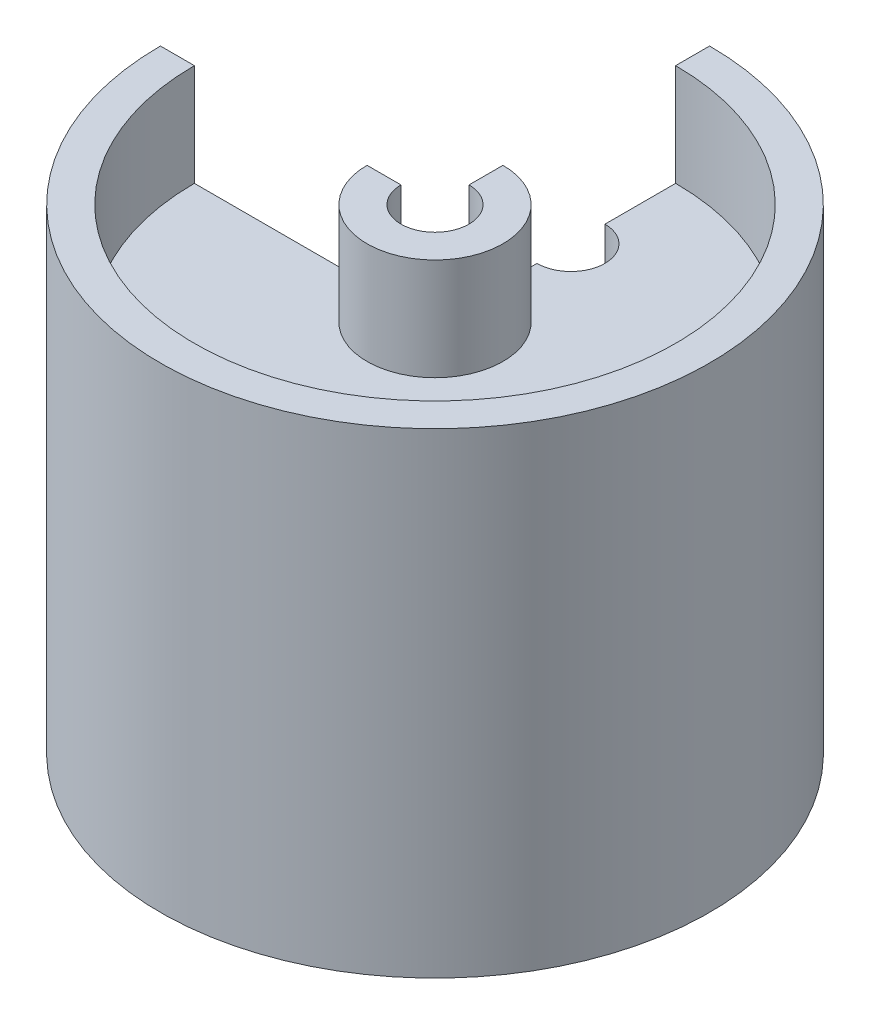
ISO-10303-21;
HEADER;
FILE_DESCRIPTION(('STEP AP214'),'2;1');
FILE_NAME('part.step','',(''),(''),'','','');
FILE_SCHEMA(('AUTOMOTIVE_DESIGN { 1 0 10303 214 1 1 1 1 }'));
ENDSEC;
DATA;
#1=APPLICATION_CONTEXT('core data for automotive mechanical design processes');
#2=APPLICATION_PROTOCOL_DEFINITION('international standard','automotive_design',2000,#1);
#3=PRODUCT_CONTEXT('',#1,'mechanical');
#4=PRODUCT('Part','Part','',(#3));
#5=PRODUCT_RELATED_PRODUCT_CATEGORY('part','',(#4));
#6=PRODUCT_DEFINITION_FORMATION('','',#4);
#7=PRODUCT_DEFINITION_CONTEXT('part definition',#1,'design');
#8=PRODUCT_DEFINITION('design','',#6,#7);
#9=PRODUCT_DEFINITION_SHAPE('','',#8);
#10=(LENGTH_UNIT() NAMED_UNIT(*) SI_UNIT(.MILLI.,.METRE.));
#11=(NAMED_UNIT(*) PLANE_ANGLE_UNIT() SI_UNIT($,.RADIAN.));
#12=(NAMED_UNIT(*) SI_UNIT($,.STERADIAN.) SOLID_ANGLE_UNIT());
#13=UNCERTAINTY_MEASURE_WITH_UNIT(LENGTH_MEASURE(1.E-05),#10,'distance_accuracy_value','');
#14=(GEOMETRIC_REPRESENTATION_CONTEXT(3) GLOBAL_UNCERTAINTY_ASSIGNED_CONTEXT((#13)) GLOBAL_UNIT_ASSIGNED_CONTEXT((#10,
#11,#12)) REPRESENTATION_CONTEXT('',''));
#15=CARTESIAN_POINT('',(0.,0.,0.));
#16=DIRECTION('',(0.,0.,1.));
#17=DIRECTION('',(1.,0.,0.));
#18=AXIS2_PLACEMENT_3D('',#15,#16,#17);
#19=CARTESIAN_POINT('',(0.,0.,0.));
#20=DIRECTION('',(1.,0.,0.));
#21=DIRECTION('',(0.,0.,-1.));
#22=AXIS2_PLACEMENT_3D('',#19,#20,#21);
#23=PLANE('',#22);
#24=DIRECTION('',(0.,-1.,0.));
#25=VECTOR('',#24,1.);
#26=CARTESIAN_POINT('',(0.,45.0234349741081,-9.525));
#27=LINE('',#26,#25);
#28=CARTESIAN_POINT('',(0.,32.3234349741081,-9.525));
#29=VERTEX_POINT('',#28);
#30=CARTESIAN_POINT('',(0.,35.4984349741081,-9.525));
#31=VERTEX_POINT('',#30);
#32=EDGE_CURVE('E11',#29,#31,#27,.F.);
#33=ORIENTED_EDGE('',*,*,#32,.F.);
#34=DIRECTION('',(0.,0.,-1.));
#35=VECTOR('',#34,1.);
#36=CARTESIAN_POINT('',(0.,32.3234349741081,-22.479));
#37=LINE('',#36,#35);
#38=CARTESIAN_POINT('',(0.,32.3234349741081,-6.35));
#39=VERTEX_POINT('',#38);
#40=EDGE_CURVE('E154',#39,#29,#37,.T.);
#41=ORIENTED_EDGE('',*,*,#40,.F.);
#42=DIRECTION('',(0.,1.,0.));
#43=VECTOR('',#42,1.);
#44=CARTESIAN_POINT('',(0.,32.3234349741081,-6.35));
#45=LINE('',#44,#43);
#46=CARTESIAN_POINT('',(0.,0.57343497410807,-6.35));
#47=VERTEX_POINT('',#46);
#48=EDGE_CURVE('E164',#47,#39,#45,.T.);
#49=ORIENTED_EDGE('',*,*,#48,.F.);
#50=DIRECTION('',(0.,0.,-1.));
#51=VECTOR('',#50,1.);
#52=CARTESIAN_POINT('',(0.,0.57343497410807,-3.17500000000001));
#53=LINE('',#52,#51);
#54=CARTESIAN_POINT('',(0.,0.57343497410807,-3.17500000000001));
#55=VERTEX_POINT('',#54);
#56=EDGE_CURVE('E169',#55,#47,#53,.T.);
#57=ORIENTED_EDGE('',*,*,#56,.F.);
#58=DIRECTION('',(0.,-1.,0.));
#59=VECTOR('',#58,1.);
#60=CARTESIAN_POINT('',(0.,45.0234349741081,-3.175));
#61=LINE('',#60,#59);
#62=CARTESIAN_POINT('',(0.,45.0234349741081,-3.175));
#63=VERTEX_POINT('',#62);
#64=EDGE_CURVE('E285',#63,#55,#61,.T.);
#65=ORIENTED_EDGE('',*,*,#64,.F.);
#66=DIRECTION('',(0.,0.,1.));
#67=VECTOR('',#66,1.);
#68=CARTESIAN_POINT('',(0.,45.0234349741081,-6.35));
#69=LINE('',#68,#67);
#70=CARTESIAN_POINT('',(0.,45.0234349741081,-6.35));
#71=VERTEX_POINT('',#70);
#72=EDGE_CURVE('E156',#71,#63,#69,.T.);
#73=ORIENTED_EDGE('',*,*,#72,.F.);
#74=DIRECTION('',(0.,1.,0.));
#75=VECTOR('',#74,1.);
#76=CARTESIAN_POINT('',(0.,35.4984349741081,-6.35));
#77=LINE('',#76,#75);
#78=CARTESIAN_POINT('',(0.,35.4984349741081,-6.35));
#79=VERTEX_POINT('',#78);
#80=EDGE_CURVE('E195',#79,#71,#77,.T.);
#81=ORIENTED_EDGE('',*,*,#80,.F.);
#82=DIRECTION('',(0.,0.,1.));
#83=VECTOR('',#82,1.);
#84=CARTESIAN_POINT('',(0.,35.4984349741081,-22.479));
#85=LINE('',#84,#83);
#86=EDGE_CURVE('E191',#31,#79,#85,.T.);
#87=ORIENTED_EDGE('',*,*,#86,.F.);
#88=EDGE_LOOP('',(#33,#41,#49,#57,#65,#73,#81,#87));
#89=FACE_BOUND('',#88,.T.);
#90=ADVANCED_FACE('F39',(#89),#23,.F.);
#91=DIRECTION('',(0.,-1.,0.));
#92=VECTOR('',#91,1.);
#93=CARTESIAN_POINT('',(0.,45.0234349741081,-15.875));
#94=LINE('',#93,#92);
#95=CARTESIAN_POINT('',(0.,35.4984349741081,-15.875));
#96=VERTEX_POINT('',#95);
#97=CARTESIAN_POINT('',(0.,32.3234349741081,-15.875));
#98=VERTEX_POINT('',#97);
#99=EDGE_CURVE('E48',#96,#98,#94,.T.);
#100=ORIENTED_EDGE('',*,*,#99,.F.);
#101=CARTESIAN_POINT('',(0.,35.4984349741081,-22.479));
#102=VERTEX_POINT('',#101);
#103=EDGE_CURVE('E192',#102,#96,#85,.T.);
#104=ORIENTED_EDGE('',*,*,#103,.F.);
#105=DIRECTION('',(0.,-1.,0.));
#106=VECTOR('',#105,1.);
#107=CARTESIAN_POINT('',(0.,35.4984349741081,-22.479));
#108=LINE('',#107,#106);
#109=CARTESIAN_POINT('',(0.,45.0234349741081,-22.479));
#110=VERTEX_POINT('',#109);
#111=EDGE_CURVE('E187',#110,#102,#108,.T.);
#112=ORIENTED_EDGE('',*,*,#111,.F.);
#113=DIRECTION('',(0.,0.,1.));
#114=VECTOR('',#113,1.);
#115=CARTESIAN_POINT('',(0.,45.0234349741081,-22.479));
#116=LINE('',#115,#114);
#117=CARTESIAN_POINT('',(0.,45.0234349741081,-25.654));
#118=VERTEX_POINT('',#117);
#119=EDGE_CURVE('E183',#118,#110,#116,.T.);
#120=ORIENTED_EDGE('',*,*,#119,.F.);
#121=DIRECTION('',(0.,1.,0.));
#122=VECTOR('',#121,1.);
#123=CARTESIAN_POINT('',(0.,45.0234349741081,-25.654));
#124=LINE('',#123,#122);
#125=CARTESIAN_POINT('',(0.,0.573434974108077,-25.654));
#126=VERTEX_POINT('',#125);
#127=EDGE_CURVE('E179',#126,#118,#124,.T.);
#128=ORIENTED_EDGE('',*,*,#127,.F.);
#129=DIRECTION('',(0.,0.,-1.));
#130=VECTOR('',#129,1.);
#131=CARTESIAN_POINT('',(0.,0.573434974108077,-25.654));
#132=LINE('',#131,#130);
#133=CARTESIAN_POINT('',(0.,0.573434974108077,-22.479));
#134=VERTEX_POINT('',#133);
#135=EDGE_CURVE('E175',#134,#126,#132,.T.);
#136=ORIENTED_EDGE('',*,*,#135,.F.);
#137=DIRECTION('',(0.,-1.,0.));
#138=VECTOR('',#137,1.);
#139=CARTESIAN_POINT('',(0.,0.573434974108077,-22.479));
#140=LINE('',#139,#138);
#141=CARTESIAN_POINT('',(0.,32.3234349741081,-22.479));
#142=VERTEX_POINT('',#141);
#143=EDGE_CURVE('E162',#142,#134,#140,.T.);
#144=ORIENTED_EDGE('',*,*,#143,.F.);
#145=EDGE_CURVE('E151',#98,#142,#37,.T.);
#146=ORIENTED_EDGE('',*,*,#145,.F.);
#147=EDGE_LOOP('',(#100,#104,#112,#120,#128,#136,#144,#146));
#148=FACE_BOUND('',#147,.T.);
#149=ADVANCED_FACE('F159',(#148),#23,.F.);
#150=CARTESIAN_POINT('',(-6.35,45.0234349741081,0.));
#151=DIRECTION('',(0.,-1.,0.));
#152=DIRECTION('',(0.,0.,-1.));
#153=AXIS2_PLACEMENT_3D('',#150,#151,#152);
#154=PLANE('',#153);
#155=CARTESIAN_POINT('',(0.,45.0234349741081,0.));
#156=DIRECTION('',(0.,1.,0.));
#157=DIRECTION('',(0.,0.,1.));
#158=AXIS2_PLACEMENT_3D('',#155,#156,#157);
#159=CIRCLE('',#158,3.175);
#160=CARTESIAN_POINT('',(-3.175,45.0234349741081,0.));
#161=VERTEX_POINT('',#160);
#162=EDGE_CURVE('E147',#161,#63,#159,.T.);
#163=ORIENTED_EDGE('',*,*,#162,.F.);
#164=DIRECTION('',(1.,0.,0.));
#165=VECTOR('',#164,1.);
#166=CARTESIAN_POINT('',(-6.35,45.0234349741081,0.));
#167=LINE('',#166,#165);
#168=CARTESIAN_POINT('',(-6.35,45.0234349741081,0.));
#169=VERTEX_POINT('',#168);
#170=EDGE_CURVE('E198',#169,#161,#167,.T.);
#171=ORIENTED_EDGE('',*,*,#170,.F.);
#172=CARTESIAN_POINT('',(0.,45.0234349741081,0.));
#173=DIRECTION('',(0.,1.,0.));
#174=DIRECTION('',(0.,0.,1.));
#175=AXIS2_PLACEMENT_3D('',#172,#173,#174);
#176=CIRCLE('',#175,6.35);
#177=EDGE_CURVE('E62',#169,#71,#176,.T.);
#178=ORIENTED_EDGE('',*,*,#177,.T.);
#179=ORIENTED_EDGE('',*,*,#72,.T.);
#180=EDGE_LOOP('',(#163,#171,#178,#179));
#181=FACE_BOUND('',#180,.T.);
#182=ADVANCED_FACE('F289',(#181),#154,.F.);
#183=CARTESIAN_POINT('',(0.,45.0234349741081,0.));
#184=DIRECTION('',(0.,1.,0.));
#185=DIRECTION('',(0.,0.,1.));
#186=AXIS2_PLACEMENT_3D('',#183,#184,#185);
#187=CYLINDRICAL_SURFACE('',#186,3.175);
#188=CARTESIAN_POINT('',(0.,0.57343497410807,0.));
#189=DIRECTION('',(0.,1.,0.));
#190=DIRECTION('',(0.,0.,1.));
#191=AXIS2_PLACEMENT_3D('',#188,#189,#190);
#192=CIRCLE('',#191,3.17500000000001);
#193=CARTESIAN_POINT('',(-3.17500000000001,0.57343497410807,0.));
#194=VERTEX_POINT('',#193);
#195=EDGE_CURVE('E276',#194,#55,#192,.T.);
#196=ORIENTED_EDGE('',*,*,#195,.F.);
#197=DIRECTION('',(0.,-1.,0.));
#198=VECTOR('',#197,1.);
#199=CARTESIAN_POINT('',(-3.175,45.0234349741081,0.));
#200=LINE('',#199,#198);
#201=EDGE_CURVE('E202',#161,#194,#200,.T.);
#202=ORIENTED_EDGE('',*,*,#201,.F.);
#203=ORIENTED_EDGE('',*,*,#162,.T.);
#204=ORIENTED_EDGE('',*,*,#64,.T.);
#205=EDGE_LOOP('',(#196,#202,#203,#204));
#206=FACE_BOUND('',#205,.T.);
#207=ADVANCED_FACE('F41',(#206),#187,.F.);
#208=CARTESIAN_POINT('',(-3.17500000000001,0.57343497410807,0.));
#209=DIRECTION('',(0.,1.,0.));
#210=DIRECTION('',(0.,0.,1.));
#211=AXIS2_PLACEMENT_3D('',#208,#209,#210);
#212=PLANE('',#211);
#213=CARTESIAN_POINT('',(0.,0.57343497410807,0.));
#214=DIRECTION('',(0.,1.,0.));
#215=DIRECTION('',(0.,0.,1.));
#216=AXIS2_PLACEMENT_3D('',#213,#214,#215);
#217=CIRCLE('',#216,6.35);
#218=CARTESIAN_POINT('',(-6.35,0.57343497410807,0.));
#219=VERTEX_POINT('',#218);
#220=EDGE_CURVE('E273',#219,#47,#217,.T.);
#221=ORIENTED_EDGE('',*,*,#220,.F.);
#222=DIRECTION('',(-1.,0.,0.));
#223=VECTOR('',#222,1.);
#224=CARTESIAN_POINT('',(-3.17500000000001,0.57343497410807,0.));
#225=LINE('',#224,#223);
#226=EDGE_CURVE('E206',#194,#219,#225,.T.);
#227=ORIENTED_EDGE('',*,*,#226,.F.);
#228=ORIENTED_EDGE('',*,*,#195,.T.);
#229=ORIENTED_EDGE('',*,*,#56,.T.);
#230=EDGE_LOOP('',(#221,#227,#228,#229));
#231=FACE_BOUND('',#230,.T.);
#232=ADVANCED_FACE('F302',(#231),#212,.F.);
#233=CARTESIAN_POINT('',(0.,45.0234349741081,0.));
#234=DIRECTION('',(0.,1.,0.));
#235=DIRECTION('',(0.,0.,1.));
#236=AXIS2_PLACEMENT_3D('',#233,#234,#235);
#237=CYLINDRICAL_SURFACE('',#236,6.35);
#238=CARTESIAN_POINT('',(0.,32.3234349741081,0.));
#239=DIRECTION('',(0.,1.,0.));
#240=DIRECTION('',(0.,0.,1.));
#241=AXIS2_PLACEMENT_3D('',#238,#239,#240);
#242=CIRCLE('',#241,6.35);
#243=CARTESIAN_POINT('',(-6.35,32.3234349741081,0.));
#244=VERTEX_POINT('',#243);
#245=EDGE_CURVE('E270',#244,#39,#242,.T.);
#246=ORIENTED_EDGE('',*,*,#245,.F.);
#247=DIRECTION('',(0.,1.,0.));
#248=VECTOR('',#247,1.);
#249=CARTESIAN_POINT('',(-6.35,32.3234349741081,0.));
#250=LINE('',#249,#248);
#251=EDGE_CURVE('E210',#219,#244,#250,.T.);
#252=ORIENTED_EDGE('',*,*,#251,.F.);
#253=ORIENTED_EDGE('',*,*,#220,.T.);
#254=ORIENTED_EDGE('',*,*,#48,.T.);
#255=EDGE_LOOP('',(#246,#252,#253,#254));
#256=FACE_BOUND('',#255,.T.);
#257=ADVANCED_FACE('F305',(#256),#237,.T.);
#258=CARTESIAN_POINT('',(-22.479,32.3234349741081,-2.35455027047564E-13));
#259=DIRECTION('',(0.,1.,0.));
#260=DIRECTION('',(0.,0.,1.));
#261=AXIS2_PLACEMENT_3D('',#258,#259,#260);
#262=PLANE('',#261);
#263=CARTESIAN_POINT('',(0.,32.3234349741081,-12.7));
#264=DIRECTION('',(0.,1.,0.));
#265=DIRECTION('',(0.,0.,1.));
#266=AXIS2_PLACEMENT_3D('',#263,#264,#265);
#267=CIRCLE('',#266,3.175);
#268=EDGE_CURVE('E140',#98,#29,#267,.F.);
#269=ORIENTED_EDGE('',*,*,#268,.F.);
#270=ORIENTED_EDGE('',*,*,#145,.T.);
#271=CARTESIAN_POINT('',(0.,32.3234349741081,0.));
#272=DIRECTION('',(0.,1.,0.));
#273=DIRECTION('',(0.,0.,1.));
#274=AXIS2_PLACEMENT_3D('',#271,#272,#273);
#275=CIRCLE('',#274,22.479);
#276=CARTESIAN_POINT('',(-22.479,32.3234349741081,-2.35455027047564E-13));
#277=VERTEX_POINT('',#276);
#278=EDGE_CURVE('E267',#277,#142,#275,.T.);
#279=ORIENTED_EDGE('',*,*,#278,.F.);
#280=DIRECTION('',(-1.,0.,0.));
#281=VECTOR('',#280,1.);
#282=CARTESIAN_POINT('',(-22.479,32.3234349741081,-2.35455027047564E-13));
#283=LINE('',#282,#281);
#284=EDGE_CURVE('E214',#244,#277,#283,.T.);
#285=ORIENTED_EDGE('',*,*,#284,.F.);
#286=ORIENTED_EDGE('',*,*,#245,.T.);
#287=ORIENTED_EDGE('',*,*,#40,.T.);
#288=EDGE_LOOP('',(#269,#270,#279,#285,#286,#287));
#289=FACE_BOUND('',#288,.T.);
#290=ADVANCED_FACE('F150',(#289),#262,.F.);
#291=CARTESIAN_POINT('',(0.,45.0234349741081,0.));
#292=DIRECTION('',(0.,1.,0.));
#293=DIRECTION('',(0.,0.,1.));
#294=AXIS2_PLACEMENT_3D('',#291,#292,#293);
#295=CYLINDRICAL_SURFACE('',#294,22.479);
#296=CARTESIAN_POINT('',(0.,0.573434974108077,0.));
#297=DIRECTION('',(0.,1.,0.));
#298=DIRECTION('',(0.,0.,1.));
#299=AXIS2_PLACEMENT_3D('',#296,#297,#298);
#300=CIRCLE('',#299,22.479);
#301=CARTESIAN_POINT('',(-22.479,0.573434974108077,-2.35455027047564E-13));
#302=VERTEX_POINT('',#301);
#303=EDGE_CURVE('E264',#302,#134,#300,.T.);
#304=ORIENTED_EDGE('',*,*,#303,.F.);
#305=DIRECTION('',(0.,-1.,0.));
#306=VECTOR('',#305,1.);
#307=CARTESIAN_POINT('',(-22.479,0.573434974108077,-2.35455027047564E-13));
#308=LINE('',#307,#306);
#309=EDGE_CURVE('E218',#277,#302,#308,.T.);
#310=ORIENTED_EDGE('',*,*,#309,.F.);
#311=ORIENTED_EDGE('',*,*,#278,.T.);
#312=ORIENTED_EDGE('',*,*,#143,.T.);
#313=EDGE_LOOP('',(#304,#310,#311,#312));
#314=FACE_BOUND('',#313,.T.);
#315=ADVANCED_FACE('F312',(#314),#295,.F.);
#316=CARTESIAN_POINT('',(-25.654,0.573434974108077,-2.68711386800045E-13));
#317=DIRECTION('',(0.,1.,0.));
#318=DIRECTION('',(0.,0.,1.));
#319=AXIS2_PLACEMENT_3D('',#316,#317,#318);
#320=PLANE('',#319);
#321=CARTESIAN_POINT('',(0.,0.573434974108077,0.));
#322=DIRECTION('',(0.,1.,0.));
#323=DIRECTION('',(0.,0.,1.));
#324=AXIS2_PLACEMENT_3D('',#321,#322,#323);
#325=CIRCLE('',#324,25.654);
#326=CARTESIAN_POINT('',(-25.654,0.573434974108077,-2.68711386800045E-13));
#327=VERTEX_POINT('',#326);
#328=EDGE_CURVE('E261',#327,#126,#325,.T.);
#329=ORIENTED_EDGE('',*,*,#328,.F.);
#330=DIRECTION('',(-1.,0.,0.));
#331=VECTOR('',#330,1.);
#332=CARTESIAN_POINT('',(-25.654,0.573434974108077,-2.68711386800045E-13));
#333=LINE('',#332,#331);
#334=EDGE_CURVE('E222',#302,#327,#333,.T.);
#335=ORIENTED_EDGE('',*,*,#334,.F.);
#336=ORIENTED_EDGE('',*,*,#303,.T.);
#337=ORIENTED_EDGE('',*,*,#135,.T.);
#338=EDGE_LOOP('',(#329,#335,#336,#337));
#339=FACE_BOUND('',#338,.T.);
#340=ADVANCED_FACE('F316',(#339),#320,.F.);
#341=CARTESIAN_POINT('',(0.,45.0234349741081,0.));
#342=DIRECTION('',(0.,1.,0.));
#343=DIRECTION('',(0.,0.,1.));
#344=AXIS2_PLACEMENT_3D('',#341,#342,#343);
#345=CYLINDRICAL_SURFACE('',#344,25.654);
#346=CARTESIAN_POINT('',(0.,45.0234349741081,0.));
#347=DIRECTION('',(0.,1.,0.));
#348=DIRECTION('',(0.,0.,1.));
#349=AXIS2_PLACEMENT_3D('',#346,#347,#348);
#350=CIRCLE('',#349,25.654);
#351=CARTESIAN_POINT('',(-25.654,45.0234349741081,-2.68711386800045E-13));
#352=VERTEX_POINT('',#351);
#353=EDGE_CURVE('E258',#352,#118,#350,.T.);
#354=ORIENTED_EDGE('',*,*,#353,.F.);
#355=DIRECTION('',(0.,1.,0.));
#356=VECTOR('',#355,1.);
#357=CARTESIAN_POINT('',(-25.654,45.0234349741081,-2.68711386800045E-13));
#358=LINE('',#357,#356);
#359=EDGE_CURVE('E226',#327,#352,#358,.T.);
#360=ORIENTED_EDGE('',*,*,#359,.F.);
#361=ORIENTED_EDGE('',*,*,#328,.T.);
#362=ORIENTED_EDGE('',*,*,#127,.T.);
#363=EDGE_LOOP('',(#354,#360,#361,#362));
#364=FACE_BOUND('',#363,.T.);
#365=ADVANCED_FACE('F319',(#364),#345,.T.);
#366=CARTESIAN_POINT('',(-22.479,45.0234349741081,-2.35455027047564E-13));
#367=DIRECTION('',(0.,-1.,0.));
#368=DIRECTION('',(0.,0.,-1.));
#369=AXIS2_PLACEMENT_3D('',#366,#367,#368);
#370=PLANE('',#369);
#371=CARTESIAN_POINT('',(0.,45.0234349741081,0.));
#372=DIRECTION('',(0.,1.,0.));
#373=DIRECTION('',(0.,0.,1.));
#374=AXIS2_PLACEMENT_3D('',#371,#372,#373);
#375=CIRCLE('',#374,22.479);
#376=CARTESIAN_POINT('',(-22.479,45.0234349741081,-2.35455027047564E-13));
#377=VERTEX_POINT('',#376);
#378=EDGE_CURVE('E255',#377,#110,#375,.T.);
#379=ORIENTED_EDGE('',*,*,#378,.F.);
#380=DIRECTION('',(1.,0.,0.));
#381=VECTOR('',#380,1.);
#382=CARTESIAN_POINT('',(-22.479,45.0234349741081,-2.35455027047564E-13));
#383=LINE('',#382,#381);
#384=EDGE_CURVE('E230',#352,#377,#383,.T.);
#385=ORIENTED_EDGE('',*,*,#384,.F.);
#386=ORIENTED_EDGE('',*,*,#353,.T.);
#387=ORIENTED_EDGE('',*,*,#119,.T.);
#388=EDGE_LOOP('',(#379,#385,#386,#387));
#389=FACE_BOUND('',#388,.T.);
#390=ADVANCED_FACE('F324',(#389),#370,.F.);
#391=CARTESIAN_POINT('',(0.,45.0234349741081,0.));
#392=DIRECTION('',(0.,1.,0.));
#393=DIRECTION('',(0.,0.,1.));
#394=AXIS2_PLACEMENT_3D('',#391,#392,#393);
#395=CYLINDRICAL_SURFACE('',#394,22.479);
#396=CARTESIAN_POINT('',(0.,35.4984349741081,0.));
#397=DIRECTION('',(0.,1.,0.));
#398=DIRECTION('',(0.,0.,1.));
#399=AXIS2_PLACEMENT_3D('',#396,#397,#398);
#400=CIRCLE('',#399,22.479);
#401=CARTESIAN_POINT('',(-22.479,35.4984349741081,-2.35455027047564E-13));
#402=VERTEX_POINT('',#401);
#403=EDGE_CURVE('E252',#402,#102,#400,.T.);
#404=ORIENTED_EDGE('',*,*,#403,.F.);
#405=DIRECTION('',(0.,-1.,0.));
#406=VECTOR('',#405,1.);
#407=CARTESIAN_POINT('',(-22.479,35.4984349741081,-2.35455027047564E-13));
#408=LINE('',#407,#406);
#409=EDGE_CURVE('E234',#377,#402,#408,.T.);
#410=ORIENTED_EDGE('',*,*,#409,.F.);
#411=ORIENTED_EDGE('',*,*,#378,.T.);
#412=ORIENTED_EDGE('',*,*,#111,.T.);
#413=EDGE_LOOP('',(#404,#410,#411,#412));
#414=FACE_BOUND('',#413,.T.);
#415=ADVANCED_FACE('F327',(#414),#395,.F.);
#416=CARTESIAN_POINT('',(-22.479,35.4984349741081,-2.35455027047564E-13));
#417=DIRECTION('',(0.,-1.,0.));
#418=DIRECTION('',(0.,0.,-1.));
#419=AXIS2_PLACEMENT_3D('',#416,#417,#418);
#420=PLANE('',#419);
#421=CARTESIAN_POINT('',(0.,35.4984349741081,-12.7));
#422=DIRECTION('',(0.,-1.,0.));
#423=DIRECTION('',(0.,0.,-1.));
#424=AXIS2_PLACEMENT_3D('',#421,#422,#423);
#425=CIRCLE('',#424,3.175);
#426=EDGE_CURVE('E54',#31,#96,#425,.F.);
#427=ORIENTED_EDGE('',*,*,#426,.F.);
#428=ORIENTED_EDGE('',*,*,#86,.T.);
#429=CARTESIAN_POINT('',(0.,35.4984349741081,0.));
#430=DIRECTION('',(0.,1.,0.));
#431=DIRECTION('',(0.,0.,1.));
#432=AXIS2_PLACEMENT_3D('',#429,#430,#431);
#433=CIRCLE('',#432,6.35);
#434=CARTESIAN_POINT('',(-6.35,35.4984349741081,0.));
#435=VERTEX_POINT('',#434);
#436=EDGE_CURVE('E248',#435,#79,#433,.T.);
#437=ORIENTED_EDGE('',*,*,#436,.F.);
#438=DIRECTION('',(1.,0.,0.));
#439=VECTOR('',#438,1.);
#440=CARTESIAN_POINT('',(-22.479,35.4984349741081,-2.35455027047564E-13));
#441=LINE('',#440,#439);
#442=EDGE_CURVE('E238',#402,#435,#441,.T.);
#443=ORIENTED_EDGE('',*,*,#442,.F.);
#444=ORIENTED_EDGE('',*,*,#403,.T.);
#445=ORIENTED_EDGE('',*,*,#103,.T.);
#446=EDGE_LOOP('',(#427,#428,#437,#443,#444,#445));
#447=FACE_BOUND('',#446,.T.);
#448=ADVANCED_FACE('F330',(#447),#420,.F.);
#449=CARTESIAN_POINT('',(0.,45.0234349741081,0.));
#450=DIRECTION('',(0.,1.,0.));
#451=DIRECTION('',(0.,0.,1.));
#452=AXIS2_PLACEMENT_3D('',#449,#450,#451);
#453=CYLINDRICAL_SURFACE('',#452,6.35);
#454=DIRECTION('',(0.,1.,0.));
#455=VECTOR('',#454,1.);
#456=CARTESIAN_POINT('',(-6.35,35.4984349741081,0.));
#457=LINE('',#456,#455);
#458=EDGE_CURVE('E242',#435,#169,#457,.T.);
#459=ORIENTED_EDGE('',*,*,#458,.F.);
#460=ORIENTED_EDGE('',*,*,#436,.T.);
#461=ORIENTED_EDGE('',*,*,#80,.T.);
#462=ORIENTED_EDGE('',*,*,#177,.F.);
#463=EDGE_LOOP('',(#459,#460,#461,#462));
#464=FACE_BOUND('',#463,.T.);
#465=ADVANCED_FACE('F332',(#464),#453,.T.);
#466=CARTESIAN_POINT('',(0.,0.,0.));
#467=DIRECTION('',(0.,0.,-1.));
#468=DIRECTION('',(-1.,0.,0.));
#469=AXIS2_PLACEMENT_3D('',#466,#467,#468);
#470=PLANE('',#469);
#471=ORIENTED_EDGE('',*,*,#170,.T.);
#472=ORIENTED_EDGE('',*,*,#201,.T.);
#473=ORIENTED_EDGE('',*,*,#226,.T.);
#474=ORIENTED_EDGE('',*,*,#251,.T.);
#475=ORIENTED_EDGE('',*,*,#284,.T.);
#476=ORIENTED_EDGE('',*,*,#309,.T.);
#477=ORIENTED_EDGE('',*,*,#334,.T.);
#478=ORIENTED_EDGE('',*,*,#359,.T.);
#479=ORIENTED_EDGE('',*,*,#384,.T.);
#480=ORIENTED_EDGE('',*,*,#409,.T.);
#481=ORIENTED_EDGE('',*,*,#442,.T.);
#482=ORIENTED_EDGE('',*,*,#458,.T.);
#483=EDGE_LOOP('',(#471,#472,#473,#474,#475,#476,#477,#478,#479,#480,#481,#482));
#484=FACE_BOUND('',#483,.T.);
#485=ADVANCED_FACE('F309',(#484),#470,.T.);
#486=CARTESIAN_POINT('',(0.,45.0234349741081,-12.7));
#487=DIRECTION('',(0.,-1.,0.));
#488=DIRECTION('',(0.,0.,-1.));
#489=AXIS2_PLACEMENT_3D('',#486,#487,#488);
#490=CYLINDRICAL_SURFACE('',#489,3.175);
#491=ORIENTED_EDGE('',*,*,#32,.T.);
#492=ORIENTED_EDGE('',*,*,#426,.T.);
#493=ORIENTED_EDGE('',*,*,#99,.T.);
#494=ORIENTED_EDGE('',*,*,#268,.T.);
#495=EDGE_LOOP('',(#491,#492,#493,#494));
#496=FACE_BOUND('',#495,.T.);
#497=ADVANCED_FACE('F139',(#496),#490,.F.);
#498=CLOSED_SHELL('',(#90,#149,#182,#207,#232,#257,#290,#315,#340,#365,#390,#415,#448,#465,#485,#497));
#499=MANIFOLD_SOLID_BREP('B2',#498);
#500=ADVANCED_BREP_SHAPE_REPRESENTATION('',(#18,#499),#14);
#501=SHAPE_DEFINITION_REPRESENTATION(#9,#500);
ENDSEC;
END-ISO-10303-21;
